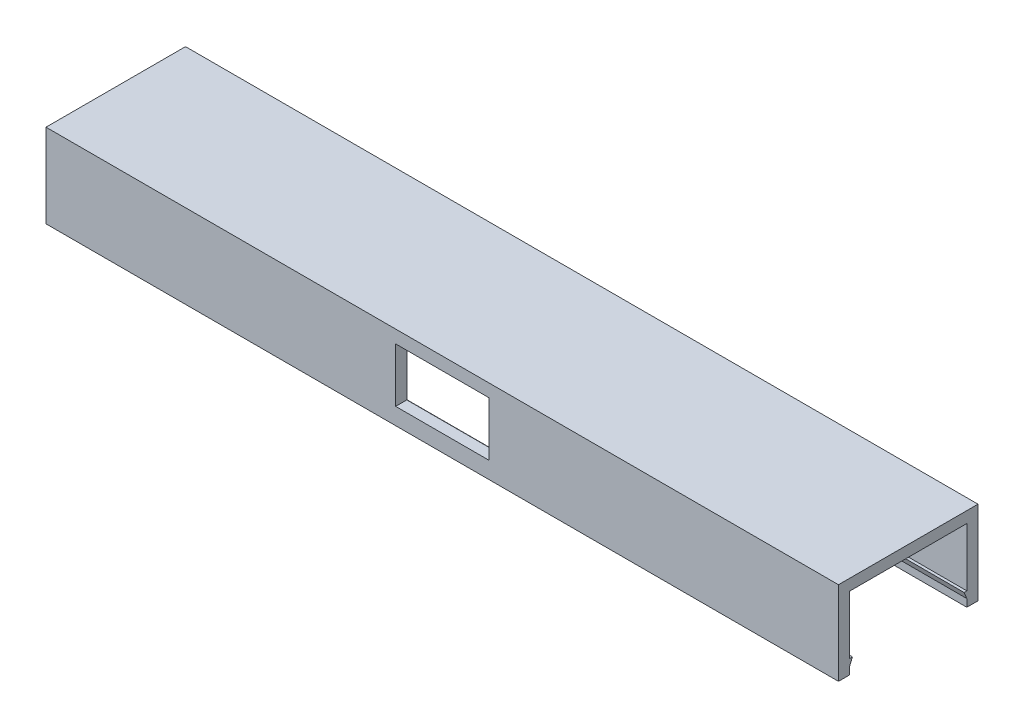
ISO-10303-21;
HEADER;
FILE_DESCRIPTION(('STEP AP214'),'2;1');
FILE_NAME('part.step','',(''),(''),'','','');
FILE_SCHEMA(('AUTOMOTIVE_DESIGN { 1 0 10303 214 1 1 1 1 }'));
ENDSEC;
DATA;
#1=APPLICATION_CONTEXT('core data for automotive mechanical design processes');
#2=APPLICATION_PROTOCOL_DEFINITION('international standard','automotive_design',2000,#1);
#3=PRODUCT_CONTEXT('',#1,'mechanical');
#4=PRODUCT('Part','Part','',(#3));
#5=PRODUCT_RELATED_PRODUCT_CATEGORY('part','',(#4));
#6=PRODUCT_DEFINITION_FORMATION('','',#4);
#7=PRODUCT_DEFINITION_CONTEXT('part definition',#1,'design');
#8=PRODUCT_DEFINITION('design','',#6,#7);
#9=PRODUCT_DEFINITION_SHAPE('','',#8);
#10=(LENGTH_UNIT() NAMED_UNIT(*) SI_UNIT(.MILLI.,.METRE.));
#11=(NAMED_UNIT(*) PLANE_ANGLE_UNIT() SI_UNIT($,.RADIAN.));
#12=(NAMED_UNIT(*) SI_UNIT($,.STERADIAN.) SOLID_ANGLE_UNIT());
#13=UNCERTAINTY_MEASURE_WITH_UNIT(LENGTH_MEASURE(1.E-05),#10,'distance_accuracy_value','');
#14=(GEOMETRIC_REPRESENTATION_CONTEXT(3) GLOBAL_UNCERTAINTY_ASSIGNED_CONTEXT((#13)) GLOBAL_UNIT_ASSIGNED_CONTEXT((#10,
#11,#12)) REPRESENTATION_CONTEXT('',''));
#15=CARTESIAN_POINT('',(0.,0.,0.));
#16=DIRECTION('',(0.,0.,1.));
#17=DIRECTION('',(1.,0.,0.));
#18=AXIS2_PLACEMENT_3D('',#15,#16,#17);
#19=CARTESIAN_POINT('',(159.,13.,10.5));
#20=DIRECTION('',(0.,0.,1.));
#21=DIRECTION('',(1.,0.,0.));
#22=AXIS2_PLACEMENT_3D('',#19,#20,#21);
#23=PLANE('',#22);
#24=DIRECTION('',(-1.,0.,0.));
#25=VECTOR('',#24,1.);
#26=CARTESIAN_POINT('',(159.,12.7,10.5));
#27=LINE('',#26,#25);
#28=CARTESIAN_POINT('',(8.35,12.7,10.5));
#29=VERTEX_POINT('',#28);
#30=CARTESIAN_POINT('',(-8.35,12.7,10.5));
#31=VERTEX_POINT('',#30);
#32=EDGE_CURVE('E227',#29,#31,#27,.T.);
#33=ORIENTED_EDGE('',*,*,#32,.T.);
#34=DIRECTION('',(0.,-1.,0.));
#35=VECTOR('',#34,1.);
#36=CARTESIAN_POINT('',(-8.35,13.,10.5));
#37=LINE('',#36,#35);
#38=CARTESIAN_POINT('',(-8.35,3.,10.5));
#39=VERTEX_POINT('',#38);
#40=EDGE_CURVE('E232',#31,#39,#37,.T.);
#41=ORIENTED_EDGE('',*,*,#40,.T.);
#42=DIRECTION('',(1.,0.,0.));
#43=VECTOR('',#42,1.);
#44=CARTESIAN_POINT('',(159.,3.,10.5));
#45=LINE('',#44,#43);
#46=CARTESIAN_POINT('',(8.35,3.,10.5));
#47=VERTEX_POINT('',#46);
#48=EDGE_CURVE('E220',#39,#47,#45,.T.);
#49=ORIENTED_EDGE('',*,*,#48,.T.);
#50=DIRECTION('',(0.,1.,0.));
#51=VECTOR('',#50,1.);
#52=CARTESIAN_POINT('',(8.35,12.9999999999999,10.5));
#53=LINE('',#52,#51);
#54=EDGE_CURVE('E189',#47,#29,#53,.T.);
#55=ORIENTED_EDGE('',*,*,#54,.T.);
#56=EDGE_LOOP('',(#33,#41,#49,#55));
#57=FACE_BOUND('',#56,.T.);
#58=DIRECTION('',(0.,1.,0.));
#59=VECTOR('',#58,1.);
#60=CARTESIAN_POINT('',(71.,15.,10.5));
#61=LINE('',#60,#59);
#62=CARTESIAN_POINT('',(71.,2.55,10.5));
#63=VERTEX_POINT('',#62);
#64=CARTESIAN_POINT('',(71.,13.,10.5));
#65=VERTEX_POINT('',#64);
#66=EDGE_CURVE('E291',#63,#65,#61,.T.);
#67=ORIENTED_EDGE('',*,*,#66,.F.);
#68=DIRECTION('',(-1.,0.,0.));
#69=VECTOR('',#68,1.);
#70=CARTESIAN_POINT('',(72.3,2.55,10.5));
#71=LINE('',#70,#69);
#72=CARTESIAN_POINT('',(-71.,2.55,10.5));
#73=VERTEX_POINT('',#72);
#74=EDGE_CURVE('E240',#63,#73,#71,.T.);
#75=ORIENTED_EDGE('',*,*,#74,.T.);
#76=DIRECTION('',(0.,1.,0.));
#77=VECTOR('',#76,1.);
#78=CARTESIAN_POINT('',(-71.,13.,10.5));
#79=LINE('',#78,#77);
#80=CARTESIAN_POINT('',(-71.,13.,10.5));
#81=VERTEX_POINT('',#80);
#82=EDGE_CURVE('E278',#73,#81,#79,.T.);
#83=ORIENTED_EDGE('',*,*,#82,.T.);
#84=DIRECTION('',(-1.,0.,0.));
#85=VECTOR('',#84,1.);
#86=CARTESIAN_POINT('',(159.,13.,10.5));
#87=LINE('',#86,#85);
#88=EDGE_CURVE('E283',#65,#81,#87,.T.);
#89=ORIENTED_EDGE('',*,*,#88,.F.);
#90=EDGE_LOOP('',(#67,#75,#83,#89));
#91=FACE_BOUND('',#90,.T.);
#92=ADVANCED_FACE('F35',(#57,#91),#23,.F.);
#93=CARTESIAN_POINT('',(159.,13.,-10.5));
#94=DIRECTION('',(0.,0.,-1.));
#95=DIRECTION('',(-1.,0.,0.));
#96=AXIS2_PLACEMENT_3D('',#93,#94,#95);
#97=PLANE('',#96);
#98=DIRECTION('',(0.,-1.,0.));
#99=VECTOR('',#98,1.);
#100=CARTESIAN_POINT('',(71.,15.,-10.5));
#101=LINE('',#100,#99);
#102=CARTESIAN_POINT('',(71.,1.35,-10.5));
#103=VERTEX_POINT('',#102);
#104=CARTESIAN_POINT('',(71.,0.,-10.5));
#105=VERTEX_POINT('',#104);
#106=EDGE_CURVE('E286',#103,#105,#101,.T.);
#107=ORIENTED_EDGE('',*,*,#106,.F.);
#108=DIRECTION('',(-1.,0.,0.));
#109=VECTOR('',#108,1.);
#110=CARTESIAN_POINT('',(72.3,1.35,-10.5));
#111=LINE('',#110,#109);
#112=CARTESIAN_POINT('',(-71.,1.35,-10.5));
#113=VERTEX_POINT('',#112);
#114=EDGE_CURVE('E258',#103,#113,#111,.T.);
#115=ORIENTED_EDGE('',*,*,#114,.T.);
#116=DIRECTION('',(0.,-1.,0.));
#117=VECTOR('',#116,1.);
#118=CARTESIAN_POINT('',(-71.,13.,-10.5));
#119=LINE('',#118,#117);
#120=CARTESIAN_POINT('',(-71.,0.,-10.5));
#121=VERTEX_POINT('',#120);
#122=EDGE_CURVE('E274',#113,#121,#119,.T.);
#123=ORIENTED_EDGE('',*,*,#122,.T.);
#124=DIRECTION('',(-1.,0.,0.));
#125=VECTOR('',#124,1.);
#126=CARTESIAN_POINT('',(0.,0.,-10.5));
#127=LINE('',#126,#125);
#128=EDGE_CURVE('E332',#105,#121,#127,.T.);
#129=ORIENTED_EDGE('',*,*,#128,.F.);
#130=EDGE_LOOP('',(#107,#115,#123,#129));
#131=FACE_BOUND('',#130,.T.);
#132=ADVANCED_FACE('F379',(#131),#97,.F.);
#133=CARTESIAN_POINT('',(0.,0.,0.));
#134=DIRECTION('',(0.,1.,0.));
#135=DIRECTION('',(0.,0.,1.));
#136=AXIS2_PLACEMENT_3D('',#133,#134,#135);
#137=PLANE('',#136);
#138=DIRECTION('',(0.,0.,-1.));
#139=VECTOR('',#138,1.);
#140=CARTESIAN_POINT('',(-71.,0.,0.));
#141=LINE('',#140,#139);
#142=CARTESIAN_POINT('',(-71.,0.,12.5));
#143=VERTEX_POINT('',#142);
#144=CARTESIAN_POINT('',(-71.,0.,10.5));
#145=VERTEX_POINT('',#144);
#146=EDGE_CURVE('E318',#143,#145,#141,.T.);
#147=ORIENTED_EDGE('',*,*,#146,.T.);
#148=DIRECTION('',(1.,0.,0.));
#149=VECTOR('',#148,1.);
#150=CARTESIAN_POINT('',(0.,0.,10.5));
#151=LINE('',#150,#149);
#152=CARTESIAN_POINT('',(71.,0.,10.5));
#153=VERTEX_POINT('',#152);
#154=EDGE_CURVE('E335',#145,#153,#151,.T.);
#155=ORIENTED_EDGE('',*,*,#154,.T.);
#156=DIRECTION('',(0.,0.,-1.));
#157=VECTOR('',#156,1.);
#158=CARTESIAN_POINT('',(71.,0.,0.));
#159=LINE('',#158,#157);
#160=CARTESIAN_POINT('',(71.,0.,12.5));
#161=VERTEX_POINT('',#160);
#162=EDGE_CURVE('E311',#161,#153,#159,.T.);
#163=ORIENTED_EDGE('',*,*,#162,.F.);
#164=DIRECTION('',(1.,0.,0.));
#165=VECTOR('',#164,1.);
#166=CARTESIAN_POINT('',(0.,0.,12.5));
#167=LINE('',#166,#165);
#168=EDGE_CURVE('E302',#143,#161,#167,.T.);
#169=ORIENTED_EDGE('',*,*,#168,.F.);
#170=EDGE_LOOP('',(#147,#155,#163,#169));
#171=FACE_BOUND('',#170,.T.);
#172=ADVANCED_FACE('F388',(#171),#137,.F.);
#173=CARTESIAN_POINT('',(71.,15.,0.));
#174=DIRECTION('',(-1.,0.,0.));
#175=DIRECTION('',(0.,0.,1.));
#176=AXIS2_PLACEMENT_3D('',#173,#174,#175);
#177=PLANE('',#176);
#178=ORIENTED_EDGE('',*,*,#162,.T.);
#179=CARTESIAN_POINT('',(71.,1.35,10.5));
#180=VERTEX_POINT('',#179);
#181=EDGE_CURVE('E292',#153,#180,#61,.T.);
#182=ORIENTED_EDGE('',*,*,#181,.T.);
#183=DIRECTION('',(0.,0.923076923076923,-0.384615384615384));
#184=VECTOR('',#183,1.);
#185=CARTESIAN_POINT('',(71.,2.55,10.));
#186=LINE('',#185,#184);
#187=CARTESIAN_POINT('',(71.,2.55,10.));
#188=VERTEX_POINT('',#187);
#189=EDGE_CURVE('E239',#180,#188,#186,.T.);
#190=ORIENTED_EDGE('',*,*,#189,.T.);
#191=DIRECTION('',(0.,0.,1.));
#192=VECTOR('',#191,1.);
#193=CARTESIAN_POINT('',(71.,2.55,10.5));
#194=LINE('',#193,#192);
#195=EDGE_CURVE('E236',#188,#63,#194,.T.);
#196=ORIENTED_EDGE('',*,*,#195,.T.);
#197=ORIENTED_EDGE('',*,*,#66,.T.);
#198=DIRECTION('',(0.,0.,-1.));
#199=VECTOR('',#198,1.);
#200=CARTESIAN_POINT('',(71.,13.,0.));
#201=LINE('',#200,#199);
#202=CARTESIAN_POINT('',(71.,13.,-10.5));
#203=VERTEX_POINT('',#202);
#204=EDGE_CURVE('E295',#65,#203,#201,.T.);
#205=ORIENTED_EDGE('',*,*,#204,.T.);
#206=CARTESIAN_POINT('',(71.,2.55,-10.5));
#207=VERTEX_POINT('',#206);
#208=EDGE_CURVE('E288',#203,#207,#101,.T.);
#209=ORIENTED_EDGE('',*,*,#208,.T.);
#210=DIRECTION('',(0.,0.,1.));
#211=VECTOR('',#210,1.);
#212=CARTESIAN_POINT('',(71.,2.55,-10.5));
#213=LINE('',#212,#211);
#214=CARTESIAN_POINT('',(71.,2.55,-10.));
#215=VERTEX_POINT('',#214);
#216=EDGE_CURVE('E257',#207,#215,#213,.T.);
#217=ORIENTED_EDGE('',*,*,#216,.T.);
#218=DIRECTION('',(0.,-0.923076923076923,-0.384615384615384));
#219=VECTOR('',#218,1.);
#220=CARTESIAN_POINT('',(71.,2.55,-10.));
#221=LINE('',#220,#219);
#222=EDGE_CURVE('E254',#215,#103,#221,.T.);
#223=ORIENTED_EDGE('',*,*,#222,.T.);
#224=ORIENTED_EDGE('',*,*,#106,.T.);
#225=CARTESIAN_POINT('',(71.,0.,-12.5));
#226=VERTEX_POINT('',#225);
#227=EDGE_CURVE('E298',#105,#226,#159,.T.);
#228=ORIENTED_EDGE('',*,*,#227,.T.);
#229=DIRECTION('',(0.,-1.,0.));
#230=VECTOR('',#229,1.);
#231=CARTESIAN_POINT('',(71.,15.,-12.5));
#232=LINE('',#231,#230);
#233=CARTESIAN_POINT('',(71.,15.,-12.5));
#234=VERTEX_POINT('',#233);
#235=EDGE_CURVE('E329',#234,#226,#232,.T.);
#236=ORIENTED_EDGE('',*,*,#235,.F.);
#237=DIRECTION('',(0.,0.,-1.));
#238=VECTOR('',#237,1.);
#239=CARTESIAN_POINT('',(71.,15.,0.));
#240=LINE('',#239,#238);
#241=CARTESIAN_POINT('',(71.,15.,12.5));
#242=VERTEX_POINT('',#241);
#243=EDGE_CURVE('E299',#242,#234,#240,.T.);
#244=ORIENTED_EDGE('',*,*,#243,.F.);
#245=DIRECTION('',(0.,-1.,0.));
#246=VECTOR('',#245,1.);
#247=CARTESIAN_POINT('',(71.,15.,12.5));
#248=LINE('',#247,#246);
#249=EDGE_CURVE('E310',#242,#161,#248,.T.);
#250=ORIENTED_EDGE('',*,*,#249,.T.);
#251=EDGE_LOOP('',(#178,#182,#190,#196,#197,#205,#209,#217,#223,#224,#228,#236,#244,#250));
#252=FACE_BOUND('',#251,.T.);
#253=ADVANCED_FACE('F37',(#252),#177,.F.);
#254=CARTESIAN_POINT('',(0.,15.,-12.5));
#255=DIRECTION('',(0.,0.,-1.));
#256=DIRECTION('',(-1.,0.,0.));
#257=AXIS2_PLACEMENT_3D('',#254,#255,#256);
#258=PLANE('',#257);
#259=DIRECTION('',(0.,1.,0.));
#260=VECTOR('',#259,1.);
#261=CARTESIAN_POINT('',(-8.35,15.,-12.5));
#262=LINE('',#261,#260);
#263=CARTESIAN_POINT('',(-8.35,3.,-12.5));
#264=VERTEX_POINT('',#263);
#265=CARTESIAN_POINT('',(-8.35,12.7,-12.5));
#266=VERTEX_POINT('',#265);
#267=EDGE_CURVE('E230',#264,#266,#262,.T.);
#268=ORIENTED_EDGE('',*,*,#267,.F.);
#269=DIRECTION('',(-1.,0.,0.));
#270=VECTOR('',#269,1.);
#271=CARTESIAN_POINT('',(0.,3.,-12.5));
#272=LINE('',#271,#270);
#273=CARTESIAN_POINT('',(8.35,3.,-12.5));
#274=VERTEX_POINT('',#273);
#275=EDGE_CURVE('E218',#274,#264,#272,.T.);
#276=ORIENTED_EDGE('',*,*,#275,.F.);
#277=DIRECTION('',(0.,-1.,0.));
#278=VECTOR('',#277,1.);
#279=CARTESIAN_POINT('',(8.35,15.,-12.5));
#280=LINE('',#279,#278);
#281=CARTESIAN_POINT('',(8.35,12.7,-12.5));
#282=VERTEX_POINT('',#281);
#283=EDGE_CURVE('E222',#282,#274,#280,.T.);
#284=ORIENTED_EDGE('',*,*,#283,.F.);
#285=DIRECTION('',(1.,0.,0.));
#286=VECTOR('',#285,1.);
#287=CARTESIAN_POINT('',(0.,12.7,-12.5));
#288=LINE('',#287,#286);
#289=EDGE_CURVE('E225',#266,#282,#288,.T.);
#290=ORIENTED_EDGE('',*,*,#289,.F.);
#291=EDGE_LOOP('',(#268,#276,#284,#290));
#292=FACE_BOUND('',#291,.T.);
#293=DIRECTION('',(1.,0.,0.));
#294=VECTOR('',#293,1.);
#295=CARTESIAN_POINT('',(0.,0.,-12.5));
#296=LINE('',#295,#294);
#297=CARTESIAN_POINT('',(-71.,0.,-12.5));
#298=VERTEX_POINT('',#297);
#299=EDGE_CURVE('E314',#298,#226,#296,.T.);
#300=ORIENTED_EDGE('',*,*,#299,.F.);
#301=DIRECTION('',(0.,-1.,0.));
#302=VECTOR('',#301,1.);
#303=CARTESIAN_POINT('',(-71.,15.,-12.5));
#304=LINE('',#303,#302);
#305=CARTESIAN_POINT('',(-71.,15.,-12.5));
#306=VERTEX_POINT('',#305);
#307=EDGE_CURVE('E326',#306,#298,#304,.T.);
#308=ORIENTED_EDGE('',*,*,#307,.F.);
#309=DIRECTION('',(1.,0.,0.));
#310=VECTOR('',#309,1.);
#311=CARTESIAN_POINT('',(0.,15.,-12.5));
#312=LINE('',#311,#310);
#313=EDGE_CURVE('E301',#306,#234,#312,.T.);
#314=ORIENTED_EDGE('',*,*,#313,.T.);
#315=ORIENTED_EDGE('',*,*,#235,.T.);
#316=EDGE_LOOP('',(#300,#308,#314,#315));
#317=FACE_BOUND('',#316,.T.);
#318=ADVANCED_FACE('F361',(#292,#317),#258,.T.);
#319=CARTESIAN_POINT('',(-71.,15.,0.));
#320=DIRECTION('',(-1.,0.,0.));
#321=DIRECTION('',(0.,0.,1.));
#322=AXIS2_PLACEMENT_3D('',#319,#320,#321);
#323=PLANE('',#322);
#324=CARTESIAN_POINT('',(-71.,1.35,10.5));
#325=VERTEX_POINT('',#324);
#326=EDGE_CURVE('E279',#145,#325,#79,.T.);
#327=ORIENTED_EDGE('',*,*,#326,.F.);
#328=ORIENTED_EDGE('',*,*,#146,.F.);
#329=DIRECTION('',(0.,-1.,0.));
#330=VECTOR('',#329,1.);
#331=CARTESIAN_POINT('',(-71.,15.,12.5));
#332=LINE('',#331,#330);
#333=CARTESIAN_POINT('',(-71.,15.,12.5));
#334=VERTEX_POINT('',#333);
#335=EDGE_CURVE('E324',#334,#143,#332,.T.);
#336=ORIENTED_EDGE('',*,*,#335,.F.);
#337=DIRECTION('',(0.,0.,-1.));
#338=VECTOR('',#337,1.);
#339=CARTESIAN_POINT('',(-71.,15.,0.));
#340=LINE('',#339,#338);
#341=EDGE_CURVE('E305',#334,#306,#340,.T.);
#342=ORIENTED_EDGE('',*,*,#341,.T.);
#343=ORIENTED_EDGE('',*,*,#307,.T.);
#344=EDGE_CURVE('E317',#121,#298,#141,.T.);
#345=ORIENTED_EDGE('',*,*,#344,.F.);
#346=ORIENTED_EDGE('',*,*,#122,.F.);
#347=DIRECTION('',(0.,0.923076923076923,0.384615384615384));
#348=VECTOR('',#347,1.);
#349=CARTESIAN_POINT('',(-71.,2.55,-10.));
#350=LINE('',#349,#348);
#351=CARTESIAN_POINT('',(-71.,2.55,-10.));
#352=VERTEX_POINT('',#351);
#353=EDGE_CURVE('E253',#113,#352,#350,.T.);
#354=ORIENTED_EDGE('',*,*,#353,.T.);
#355=DIRECTION('',(0.,0.,-1.));
#356=VECTOR('',#355,1.);
#357=CARTESIAN_POINT('',(-71.,2.55,-10.5));
#358=LINE('',#357,#356);
#359=CARTESIAN_POINT('',(-71.,2.55,-10.5));
#360=VERTEX_POINT('',#359);
#361=EDGE_CURVE('E261',#352,#360,#358,.T.);
#362=ORIENTED_EDGE('',*,*,#361,.T.);
#363=CARTESIAN_POINT('',(-71.,13.,-10.5));
#364=VERTEX_POINT('',#363);
#365=EDGE_CURVE('E275',#364,#360,#119,.T.);
#366=ORIENTED_EDGE('',*,*,#365,.F.);
#367=DIRECTION('',(0.,0.,-1.));
#368=VECTOR('',#367,1.);
#369=CARTESIAN_POINT('',(-71.,13.,-10.5));
#370=LINE('',#369,#368);
#371=EDGE_CURVE('E271',#81,#364,#370,.T.);
#372=ORIENTED_EDGE('',*,*,#371,.F.);
#373=ORIENTED_EDGE('',*,*,#82,.F.);
#374=DIRECTION('',(0.,0.,-1.));
#375=VECTOR('',#374,1.);
#376=CARTESIAN_POINT('',(-71.,2.55,10.5));
#377=LINE('',#376,#375);
#378=CARTESIAN_POINT('',(-71.,2.55,10.));
#379=VERTEX_POINT('',#378);
#380=EDGE_CURVE('E235',#73,#379,#377,.T.);
#381=ORIENTED_EDGE('',*,*,#380,.T.);
#382=DIRECTION('',(0.,-0.923076923076923,0.384615384615384));
#383=VECTOR('',#382,1.);
#384=CARTESIAN_POINT('',(-71.,2.55,10.));
#385=LINE('',#384,#383);
#386=EDGE_CURVE('E243',#379,#325,#385,.T.);
#387=ORIENTED_EDGE('',*,*,#386,.T.);
#388=EDGE_LOOP('',(#327,#328,#336,#342,#343,#345,#346,#354,#362,#366,#372,#373,#381,#387));
#389=FACE_BOUND('',#388,.T.);
#390=ADVANCED_FACE('F409',(#389),#323,.T.);
#391=CARTESIAN_POINT('',(0.,15.,12.5));
#392=DIRECTION('',(0.,0.,-1.));
#393=DIRECTION('',(-1.,0.,0.));
#394=AXIS2_PLACEMENT_3D('',#391,#392,#393);
#395=PLANE('',#394);
#396=DIRECTION('',(1.,0.,0.));
#397=VECTOR('',#396,1.);
#398=CARTESIAN_POINT('',(-8.35,3.,12.5));
#399=LINE('',#398,#397);
#400=CARTESIAN_POINT('',(-8.35,3.,12.5));
#401=VERTEX_POINT('',#400);
#402=CARTESIAN_POINT('',(8.35,3.,12.5));
#403=VERTEX_POINT('',#402);
#404=EDGE_CURVE('E195',#401,#403,#399,.T.);
#405=ORIENTED_EDGE('',*,*,#404,.F.);
#406=DIRECTION('',(0.,-1.,0.));
#407=VECTOR('',#406,1.);
#408=CARTESIAN_POINT('',(-8.35,3.,12.5));
#409=LINE('',#408,#407);
#410=CARTESIAN_POINT('',(-8.35,12.7,12.5));
#411=VERTEX_POINT('',#410);
#412=EDGE_CURVE('E201',#411,#401,#409,.T.);
#413=ORIENTED_EDGE('',*,*,#412,.F.);
#414=DIRECTION('',(-1.,0.,0.));
#415=VECTOR('',#414,1.);
#416=CARTESIAN_POINT('',(-8.35,12.7,12.5));
#417=LINE('',#416,#415);
#418=CARTESIAN_POINT('',(8.35,12.7,12.5));
#419=VERTEX_POINT('',#418);
#420=EDGE_CURVE('E206',#419,#411,#417,.T.);
#421=ORIENTED_EDGE('',*,*,#420,.F.);
#422=DIRECTION('',(0.,1.,0.));
#423=VECTOR('',#422,1.);
#424=CARTESIAN_POINT('',(8.35,3.,12.5));
#425=LINE('',#424,#423);
#426=EDGE_CURVE('E186',#403,#419,#425,.T.);
#427=ORIENTED_EDGE('',*,*,#426,.F.);
#428=EDGE_LOOP('',(#405,#413,#421,#427));
#429=FACE_BOUND('',#428,.T.);
#430=ORIENTED_EDGE('',*,*,#168,.T.);
#431=ORIENTED_EDGE('',*,*,#249,.F.);
#432=DIRECTION('',(1.,0.,0.));
#433=VECTOR('',#432,1.);
#434=CARTESIAN_POINT('',(0.,15.,12.5));
#435=LINE('',#434,#433);
#436=EDGE_CURVE('E308',#334,#242,#435,.T.);
#437=ORIENTED_EDGE('',*,*,#436,.F.);
#438=ORIENTED_EDGE('',*,*,#335,.T.);
#439=EDGE_LOOP('',(#430,#431,#437,#438));
#440=FACE_BOUND('',#439,.T.);
#441=ADVANCED_FACE('F203',(#429,#440),#395,.F.);
#442=CARTESIAN_POINT('',(0.,15.,0.));
#443=DIRECTION('',(0.,1.,0.));
#444=DIRECTION('',(0.,0.,1.));
#445=AXIS2_PLACEMENT_3D('',#442,#443,#444);
#446=PLANE('',#445);
#447=ORIENTED_EDGE('',*,*,#243,.T.);
#448=ORIENTED_EDGE('',*,*,#313,.F.);
#449=ORIENTED_EDGE('',*,*,#341,.F.);
#450=ORIENTED_EDGE('',*,*,#436,.T.);
#451=EDGE_LOOP('',(#447,#448,#449,#450));
#452=FACE_BOUND('',#451,.T.);
#453=ADVANCED_FACE('F421',(#452),#446,.T.);
#454=ORIENTED_EDGE('',*,*,#227,.F.);
#455=ORIENTED_EDGE('',*,*,#128,.T.);
#456=ORIENTED_EDGE('',*,*,#344,.T.);
#457=ORIENTED_EDGE('',*,*,#299,.T.);
#458=EDGE_LOOP('',(#454,#455,#456,#457));
#459=FACE_BOUND('',#458,.T.);
#460=ADVANCED_FACE('F402',(#459),#137,.F.);
#461=CARTESIAN_POINT('',(159.,13.,-10.5));
#462=DIRECTION('',(0.,1.,0.));
#463=DIRECTION('',(0.,0.,1.));
#464=AXIS2_PLACEMENT_3D('',#461,#462,#463);
#465=PLANE('',#464);
#466=ORIENTED_EDGE('',*,*,#88,.T.);
#467=ORIENTED_EDGE('',*,*,#371,.T.);
#468=DIRECTION('',(-1.,0.,0.));
#469=VECTOR('',#468,1.);
#470=CARTESIAN_POINT('',(159.,13.,-10.5));
#471=LINE('',#470,#469);
#472=EDGE_CURVE('E282',#203,#364,#471,.T.);
#473=ORIENTED_EDGE('',*,*,#472,.F.);
#474=ORIENTED_EDGE('',*,*,#204,.F.);
#475=EDGE_LOOP('',(#466,#467,#473,#474));
#476=FACE_BOUND('',#475,.T.);
#477=ADVANCED_FACE('F394',(#476),#465,.F.);
#478=ORIENTED_EDGE('',*,*,#326,.T.);
#479=DIRECTION('',(-1.,0.,0.));
#480=VECTOR('',#479,1.);
#481=CARTESIAN_POINT('',(72.3,1.35,10.5));
#482=LINE('',#481,#480);
#483=EDGE_CURVE('E249',#180,#325,#482,.T.);
#484=ORIENTED_EDGE('',*,*,#483,.F.);
#485=ORIENTED_EDGE('',*,*,#181,.F.);
#486=ORIENTED_EDGE('',*,*,#154,.F.);
#487=EDGE_LOOP('',(#478,#484,#485,#486));
#488=FACE_BOUND('',#487,.T.);
#489=ADVANCED_FACE('F382',(#488),#23,.F.);
#490=DIRECTION('',(-1.,0.,0.));
#491=VECTOR('',#490,1.);
#492=CARTESIAN_POINT('',(159.,3.,-10.5));
#493=LINE('',#492,#491);
#494=CARTESIAN_POINT('',(8.35,3.,-10.5));
#495=VERTEX_POINT('',#494);
#496=CARTESIAN_POINT('',(-8.35,3.,-10.5));
#497=VERTEX_POINT('',#496);
#498=EDGE_CURVE('E338',#495,#497,#493,.T.);
#499=ORIENTED_EDGE('',*,*,#498,.T.);
#500=DIRECTION('',(0.,1.,0.));
#501=VECTOR('',#500,1.);
#502=CARTESIAN_POINT('',(-8.35,13.,-10.5));
#503=LINE('',#502,#501);
#504=CARTESIAN_POINT('',(-8.35,12.7,-10.5));
#505=VERTEX_POINT('',#504);
#506=EDGE_CURVE('E11',#497,#505,#503,.T.);
#507=ORIENTED_EDGE('',*,*,#506,.T.);
#508=DIRECTION('',(1.,0.,0.));
#509=VECTOR('',#508,1.);
#510=CARTESIAN_POINT('',(159.,12.7,-10.5));
#511=LINE('',#510,#509);
#512=CARTESIAN_POINT('',(8.35,12.7,-10.5));
#513=VERTEX_POINT('',#512);
#514=EDGE_CURVE('E43',#505,#513,#511,.T.);
#515=ORIENTED_EDGE('',*,*,#514,.T.);
#516=DIRECTION('',(0.,-1.,0.));
#517=VECTOR('',#516,1.);
#518=CARTESIAN_POINT('',(8.35,12.9999999999999,-10.5));
#519=LINE('',#518,#517);
#520=EDGE_CURVE('E341',#513,#495,#519,.T.);
#521=ORIENTED_EDGE('',*,*,#520,.T.);
#522=EDGE_LOOP('',(#499,#507,#515,#521));
#523=FACE_BOUND('',#522,.T.);
#524=ORIENTED_EDGE('',*,*,#365,.T.);
#525=DIRECTION('',(-1.,0.,0.));
#526=VECTOR('',#525,1.);
#527=CARTESIAN_POINT('',(72.3,2.55,-10.5));
#528=LINE('',#527,#526);
#529=EDGE_CURVE('E267',#207,#360,#528,.T.);
#530=ORIENTED_EDGE('',*,*,#529,.F.);
#531=ORIENTED_EDGE('',*,*,#208,.F.);
#532=ORIENTED_EDGE('',*,*,#472,.T.);
#533=EDGE_LOOP('',(#524,#530,#531,#532));
#534=FACE_BOUND('',#533,.T.);
#535=ADVANCED_FACE('F345',(#523,#534),#97,.F.);
#536=CARTESIAN_POINT('',(72.3,2.55,-10.));
#537=DIRECTION('',(0.,-0.384615384615384,0.923076923076924));
#538=DIRECTION('',(0.,-0.923076923076923,-0.384615384615384));
#539=AXIS2_PLACEMENT_3D('',#536,#537,#538);
#540=PLANE('',#539);
#541=ORIENTED_EDGE('',*,*,#222,.F.);
#542=DIRECTION('',(-1.,0.,0.));
#543=VECTOR('',#542,1.);
#544=CARTESIAN_POINT('',(72.3,2.55,-10.));
#545=LINE('',#544,#543);
#546=EDGE_CURVE('E264',#215,#352,#545,.T.);
#547=ORIENTED_EDGE('',*,*,#546,.T.);
#548=ORIENTED_EDGE('',*,*,#353,.F.);
#549=ORIENTED_EDGE('',*,*,#114,.F.);
#550=EDGE_LOOP('',(#541,#547,#548,#549));
#551=FACE_BOUND('',#550,.T.);
#552=ADVANCED_FACE('F401',(#551),#540,.T.);
#553=CARTESIAN_POINT('',(72.3,2.55,-10.5));
#554=DIRECTION('',(0.,1.,0.));
#555=DIRECTION('',(0.,0.,1.));
#556=AXIS2_PLACEMENT_3D('',#553,#554,#555);
#557=PLANE('',#556);
#558=ORIENTED_EDGE('',*,*,#216,.F.);
#559=ORIENTED_EDGE('',*,*,#529,.T.);
#560=ORIENTED_EDGE('',*,*,#361,.F.);
#561=ORIENTED_EDGE('',*,*,#546,.F.);
#562=EDGE_LOOP('',(#558,#559,#560,#561));
#563=FACE_BOUND('',#562,.T.);
#564=ADVANCED_FACE('F436',(#563),#557,.T.);
#565=CARTESIAN_POINT('',(72.3,2.55,10.5));
#566=DIRECTION('',(0.,1.,0.));
#567=DIRECTION('',(0.,0.,1.));
#568=AXIS2_PLACEMENT_3D('',#565,#566,#567);
#569=PLANE('',#568);
#570=ORIENTED_EDGE('',*,*,#195,.F.);
#571=DIRECTION('',(-1.,0.,0.));
#572=VECTOR('',#571,1.);
#573=CARTESIAN_POINT('',(72.3,2.55,10.));
#574=LINE('',#573,#572);
#575=EDGE_CURVE('E246',#188,#379,#574,.T.);
#576=ORIENTED_EDGE('',*,*,#575,.T.);
#577=ORIENTED_EDGE('',*,*,#380,.F.);
#578=ORIENTED_EDGE('',*,*,#74,.F.);
#579=EDGE_LOOP('',(#570,#576,#577,#578));
#580=FACE_BOUND('',#579,.T.);
#581=ADVANCED_FACE('F446',(#580),#569,.T.);
#582=CARTESIAN_POINT('',(72.3,2.55,10.));
#583=DIRECTION('',(0.,-0.384615384615384,-0.923076923076924));
#584=DIRECTION('',(0.,0.923076923076923,-0.384615384615384));
#585=AXIS2_PLACEMENT_3D('',#582,#583,#584);
#586=PLANE('',#585);
#587=ORIENTED_EDGE('',*,*,#189,.F.);
#588=ORIENTED_EDGE('',*,*,#483,.T.);
#589=ORIENTED_EDGE('',*,*,#386,.F.);
#590=ORIENTED_EDGE('',*,*,#575,.F.);
#591=EDGE_LOOP('',(#587,#588,#589,#590));
#592=FACE_BOUND('',#591,.T.);
#593=ADVANCED_FACE('F375',(#592),#586,.T.);
#594=CARTESIAN_POINT('',(-8.35,3.,-37.5));
#595=DIRECTION('',(0.,-1.,0.));
#596=DIRECTION('',(0.,0.,-1.));
#597=AXIS2_PLACEMENT_3D('',#594,#595,#596);
#598=PLANE('',#597);
#599=ORIENTED_EDGE('',*,*,#275,.T.);
#600=DIRECTION('',(0.,0.,1.));
#601=VECTOR('',#600,1.);
#602=CARTESIAN_POINT('',(-8.35,3.,-37.5));
#603=LINE('',#602,#601);
#604=EDGE_CURVE('E191',#264,#497,#603,.T.);
#605=ORIENTED_EDGE('',*,*,#604,.T.);
#606=ORIENTED_EDGE('',*,*,#498,.F.);
#607=DIRECTION('',(0.,0.,1.));
#608=VECTOR('',#607,1.);
#609=CARTESIAN_POINT('',(8.35,3.,-37.5));
#610=LINE('',#609,#608);
#611=EDGE_CURVE('E58',#274,#495,#610,.T.);
#612=ORIENTED_EDGE('',*,*,#611,.F.);
#613=EDGE_LOOP('',(#599,#605,#606,#612));
#614=FACE_BOUND('',#613,.T.);
#615=ADVANCED_FACE('F367',(#614),#598,.F.);
#616=CARTESIAN_POINT('',(8.35,3.,-37.5));
#617=DIRECTION('',(1.,0.,0.));
#618=DIRECTION('',(0.,1.,0.));
#619=AXIS2_PLACEMENT_3D('',#616,#617,#618);
#620=PLANE('',#619);
#621=ORIENTED_EDGE('',*,*,#283,.T.);
#622=ORIENTED_EDGE('',*,*,#611,.T.);
#623=ORIENTED_EDGE('',*,*,#520,.F.);
#624=DIRECTION('',(0.,0.,1.));
#625=VECTOR('',#624,1.);
#626=CARTESIAN_POINT('',(8.35,12.7,-37.5));
#627=LINE('',#626,#625);
#628=EDGE_CURVE('E214',#282,#513,#627,.T.);
#629=ORIENTED_EDGE('',*,*,#628,.F.);
#630=EDGE_LOOP('',(#621,#622,#623,#629));
#631=FACE_BOUND('',#630,.T.);
#632=ADVANCED_FACE('F365',(#631),#620,.F.);
#633=CARTESIAN_POINT('',(-8.35,12.7,-37.5));
#634=DIRECTION('',(0.,1.,0.));
#635=DIRECTION('',(0.,0.,1.));
#636=AXIS2_PLACEMENT_3D('',#633,#634,#635);
#637=PLANE('',#636);
#638=ORIENTED_EDGE('',*,*,#289,.T.);
#639=ORIENTED_EDGE('',*,*,#628,.T.);
#640=ORIENTED_EDGE('',*,*,#514,.F.);
#641=DIRECTION('',(0.,0.,1.));
#642=VECTOR('',#641,1.);
#643=CARTESIAN_POINT('',(-8.35,12.7,-37.5));
#644=LINE('',#643,#642);
#645=EDGE_CURVE('E213',#266,#505,#644,.T.);
#646=ORIENTED_EDGE('',*,*,#645,.F.);
#647=EDGE_LOOP('',(#638,#639,#640,#646));
#648=FACE_BOUND('',#647,.T.);
#649=ADVANCED_FACE('F352',(#648),#637,.F.);
#650=CARTESIAN_POINT('',(-8.35,3.,-37.5));
#651=DIRECTION('',(-1.,0.,0.));
#652=DIRECTION('',(0.,-1.,0.));
#653=AXIS2_PLACEMENT_3D('',#650,#651,#652);
#654=PLANE('',#653);
#655=ORIENTED_EDGE('',*,*,#267,.T.);
#656=ORIENTED_EDGE('',*,*,#645,.T.);
#657=ORIENTED_EDGE('',*,*,#506,.F.);
#658=ORIENTED_EDGE('',*,*,#604,.F.);
#659=EDGE_LOOP('',(#655,#656,#657,#658));
#660=FACE_BOUND('',#659,.T.);
#661=ADVANCED_FACE('F356',(#660),#654,.F.);
#662=EDGE_CURVE('E211',#31,#411,#644,.T.);
#663=ORIENTED_EDGE('',*,*,#662,.T.);
#664=ORIENTED_EDGE('',*,*,#412,.T.);
#665=EDGE_CURVE('E198',#39,#401,#603,.T.);
#666=ORIENTED_EDGE('',*,*,#665,.F.);
#667=ORIENTED_EDGE('',*,*,#40,.F.);
#668=EDGE_LOOP('',(#663,#664,#666,#667));
#669=FACE_BOUND('',#668,.T.);
#670=ADVANCED_FACE('F455',(#669),#654,.F.);
#671=EDGE_CURVE('E215',#29,#419,#627,.T.);
#672=ORIENTED_EDGE('',*,*,#671,.T.);
#673=ORIENTED_EDGE('',*,*,#420,.T.);
#674=ORIENTED_EDGE('',*,*,#662,.F.);
#675=ORIENTED_EDGE('',*,*,#32,.F.);
#676=EDGE_LOOP('',(#672,#673,#674,#675));
#677=FACE_BOUND('',#676,.T.);
#678=ADVANCED_FACE('F374',(#677),#637,.F.);
#679=EDGE_CURVE('E50',#47,#403,#610,.T.);
#680=ORIENTED_EDGE('',*,*,#679,.T.);
#681=ORIENTED_EDGE('',*,*,#426,.T.);
#682=ORIENTED_EDGE('',*,*,#671,.F.);
#683=ORIENTED_EDGE('',*,*,#54,.F.);
#684=EDGE_LOOP('',(#680,#681,#682,#683));
#685=FACE_BOUND('',#684,.T.);
#686=ADVANCED_FACE('F183',(#685),#620,.F.);
#687=ORIENTED_EDGE('',*,*,#665,.T.);
#688=ORIENTED_EDGE('',*,*,#404,.T.);
#689=ORIENTED_EDGE('',*,*,#679,.F.);
#690=ORIENTED_EDGE('',*,*,#48,.F.);
#691=EDGE_LOOP('',(#687,#688,#689,#690));
#692=FACE_BOUND('',#691,.T.);
#693=ADVANCED_FACE('F196',(#692),#598,.F.);
#694=CLOSED_SHELL('',(#92,#132,#172,#253,#318,#390,#441,#453,#460,#477,#489,#535,#552,#564,#581,
#593,#615,#632,#649,#661,#670,#678,#686,#693));
#695=MANIFOLD_SOLID_BREP('B2',#694);
#696=ADVANCED_BREP_SHAPE_REPRESENTATION('',(#18,#695),#14);
#697=SHAPE_DEFINITION_REPRESENTATION(#9,#696);
ENDSEC;
END-ISO-10303-21;
